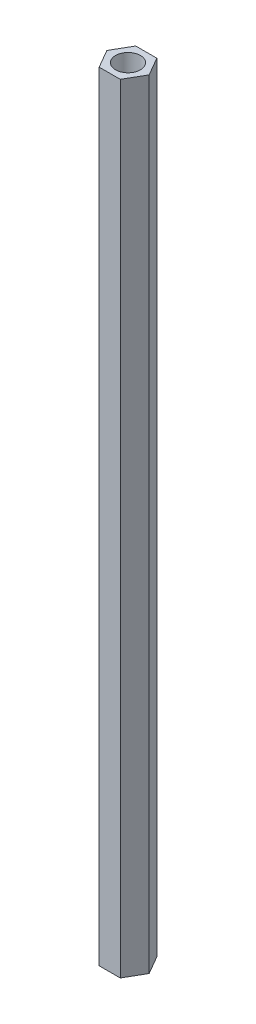
ISO-10303-21;
HEADER;
FILE_DESCRIPTION(('STEP AP214'),'2;1');
FILE_NAME('part.step','',(''),(''),'','','');
FILE_SCHEMA(('AUTOMOTIVE_DESIGN { 1 0 10303 214 1 1 1 1 }'));
ENDSEC;
DATA;
#1=APPLICATION_CONTEXT('core data for automotive mechanical design processes');
#2=APPLICATION_PROTOCOL_DEFINITION('international standard','automotive_design',2000,#1);
#3=PRODUCT_CONTEXT('',#1,'mechanical');
#4=PRODUCT('Part','Part','',(#3));
#5=PRODUCT_RELATED_PRODUCT_CATEGORY('part','',(#4));
#6=PRODUCT_DEFINITION_FORMATION('','',#4);
#7=PRODUCT_DEFINITION_CONTEXT('part definition',#1,'design');
#8=PRODUCT_DEFINITION('design','',#6,#7);
#9=PRODUCT_DEFINITION_SHAPE('','',#8);
#10=(LENGTH_UNIT() NAMED_UNIT(*) SI_UNIT(.MILLI.,.METRE.));
#11=(NAMED_UNIT(*) PLANE_ANGLE_UNIT() SI_UNIT($,.RADIAN.));
#12=(NAMED_UNIT(*) SI_UNIT($,.STERADIAN.) SOLID_ANGLE_UNIT());
#13=UNCERTAINTY_MEASURE_WITH_UNIT(LENGTH_MEASURE(1.E-05),#10,'distance_accuracy_value','');
#14=(GEOMETRIC_REPRESENTATION_CONTEXT(3) GLOBAL_UNCERTAINTY_ASSIGNED_CONTEXT((#13)) GLOBAL_UNIT_ASSIGNED_CONTEXT((#10,
#11,#12)) REPRESENTATION_CONTEXT('',''));
#15=CARTESIAN_POINT('',(0.,0.,0.));
#16=DIRECTION('',(0.,0.,1.));
#17=DIRECTION('',(1.,0.,0.));
#18=AXIS2_PLACEMENT_3D('',#15,#16,#17);
#19=CARTESIAN_POINT('',(1.35677313259562,100.,2.35));
#20=DIRECTION('',(-0.866025403784439,0.,-0.5));
#21=DIRECTION('',(-0.5,0.,0.866025403784439));
#22=AXIS2_PLACEMENT_3D('',#19,#20,#21);
#23=PLANE('',#22);
#24=DIRECTION('',(0.5,0.,-0.866025403784439));
#25=VECTOR('',#24,1.);
#26=CARTESIAN_POINT('',(1.35677313259562,0.,2.35));
#27=LINE('',#26,#25);
#28=CARTESIAN_POINT('',(1.35677313259562,0.,2.35));
#29=VERTEX_POINT('',#28);
#30=CARTESIAN_POINT('',(2.71354626519124,0.,0.));
#31=VERTEX_POINT('',#30);
#32=EDGE_CURVE('E119',#29,#31,#27,.T.);
#33=ORIENTED_EDGE('',*,*,#32,.T.);
#34=DIRECTION('',(0.,-1.,0.));
#35=VECTOR('',#34,1.);
#36=CARTESIAN_POINT('',(2.71354626519124,100.,0.));
#37=LINE('',#36,#35);
#38=CARTESIAN_POINT('',(2.71354626519124,100.,0.));
#39=VERTEX_POINT('',#38);
#40=EDGE_CURVE('E11',#39,#31,#37,.T.);
#41=ORIENTED_EDGE('',*,*,#40,.F.);
#42=DIRECTION('',(0.5,0.,-0.866025403784439));
#43=VECTOR('',#42,1.);
#44=CARTESIAN_POINT('',(1.35677313259562,100.,2.35));
#45=LINE('',#44,#43);
#46=CARTESIAN_POINT('',(1.35677313259562,100.,2.35));
#47=VERTEX_POINT('',#46);
#48=EDGE_CURVE('E130',#47,#39,#45,.T.);
#49=ORIENTED_EDGE('',*,*,#48,.F.);
#50=DIRECTION('',(0.,-1.,0.));
#51=VECTOR('',#50,1.);
#52=CARTESIAN_POINT('',(1.35677313259562,100.,2.35));
#53=LINE('',#52,#51);
#54=EDGE_CURVE('E115',#47,#29,#53,.T.);
#55=ORIENTED_EDGE('',*,*,#54,.T.);
#56=EDGE_LOOP('',(#33,#41,#49,#55));
#57=FACE_BOUND('',#56,.T.);
#58=ADVANCED_FACE('F35',(#57),#23,.F.);
#59=CARTESIAN_POINT('',(2.71354626519124,100.,0.));
#60=DIRECTION('',(-0.866025403784439,0.,0.5));
#61=DIRECTION('',(0.5,0.,0.866025403784439));
#62=AXIS2_PLACEMENT_3D('',#59,#60,#61);
#63=PLANE('',#62);
#64=DIRECTION('',(-0.5,0.,-0.866025403784439));
#65=VECTOR('',#64,1.);
#66=CARTESIAN_POINT('',(2.71354626519124,0.,0.));
#67=LINE('',#66,#65);
#68=CARTESIAN_POINT('',(1.35677313259562,0.,-2.35));
#69=VERTEX_POINT('',#68);
#70=EDGE_CURVE('E122',#31,#69,#67,.T.);
#71=ORIENTED_EDGE('',*,*,#70,.T.);
#72=DIRECTION('',(0.,-1.,0.));
#73=VECTOR('',#72,1.);
#74=CARTESIAN_POINT('',(1.35677313259562,100.,-2.35));
#75=LINE('',#74,#73);
#76=CARTESIAN_POINT('',(1.35677313259562,100.,-2.35));
#77=VERTEX_POINT('',#76);
#78=EDGE_CURVE('E43',#77,#69,#75,.T.);
#79=ORIENTED_EDGE('',*,*,#78,.F.);
#80=DIRECTION('',(-0.5,0.,-0.866025403784439));
#81=VECTOR('',#80,1.);
#82=CARTESIAN_POINT('',(2.71354626519124,100.,0.));
#83=LINE('',#82,#81);
#84=EDGE_CURVE('E88',#39,#77,#83,.T.);
#85=ORIENTED_EDGE('',*,*,#84,.F.);
#86=ORIENTED_EDGE('',*,*,#40,.T.);
#87=EDGE_LOOP('',(#71,#79,#85,#86));
#88=FACE_BOUND('',#87,.T.);
#89=ADVANCED_FACE('F155',(#88),#63,.F.);
#90=CARTESIAN_POINT('',(1.35677313259562,100.,-2.35));
#91=DIRECTION('',(0.,0.,1.));
#92=DIRECTION('',(1.,0.,0.));
#93=AXIS2_PLACEMENT_3D('',#90,#91,#92);
#94=PLANE('',#93);
#95=DIRECTION('',(-1.,0.,0.));
#96=VECTOR('',#95,1.);
#97=CARTESIAN_POINT('',(1.35677313259562,0.,-2.35));
#98=LINE('',#97,#96);
#99=CARTESIAN_POINT('',(-1.35677313259562,0.,-2.35));
#100=VERTEX_POINT('',#99);
#101=EDGE_CURVE('E125',#69,#100,#98,.T.);
#102=ORIENTED_EDGE('',*,*,#101,.T.);
#103=DIRECTION('',(0.,-1.,0.));
#104=VECTOR('',#103,1.);
#105=CARTESIAN_POINT('',(-1.35677313259562,100.,-2.35));
#106=LINE('',#105,#104);
#107=CARTESIAN_POINT('',(-1.35677313259562,100.,-2.35));
#108=VERTEX_POINT('',#107);
#109=EDGE_CURVE('E110',#108,#100,#106,.T.);
#110=ORIENTED_EDGE('',*,*,#109,.F.);
#111=DIRECTION('',(-1.,0.,0.));
#112=VECTOR('',#111,1.);
#113=CARTESIAN_POINT('',(1.35677313259562,100.,-2.35));
#114=LINE('',#113,#112);
#115=EDGE_CURVE('E101',#77,#108,#114,.T.);
#116=ORIENTED_EDGE('',*,*,#115,.F.);
#117=ORIENTED_EDGE('',*,*,#78,.T.);
#118=EDGE_LOOP('',(#102,#110,#116,#117));
#119=FACE_BOUND('',#118,.T.);
#120=ADVANCED_FACE('F136',(#119),#94,.F.);
#121=CARTESIAN_POINT('',(-1.35677313259562,100.,-2.35));
#122=DIRECTION('',(0.866025403784439,0.,0.5));
#123=DIRECTION('',(0.5,0.,-0.866025403784439));
#124=AXIS2_PLACEMENT_3D('',#121,#122,#123);
#125=PLANE('',#124);
#126=DIRECTION('',(-0.5,0.,0.866025403784439));
#127=VECTOR('',#126,1.);
#128=CARTESIAN_POINT('',(-1.35677313259562,0.,-2.35));
#129=LINE('',#128,#127);
#130=CARTESIAN_POINT('',(-2.71354626519124,0.,0.));
#131=VERTEX_POINT('',#130);
#132=EDGE_CURVE('E109',#100,#131,#129,.T.);
#133=ORIENTED_EDGE('',*,*,#132,.T.);
#134=DIRECTION('',(0.,-1.,0.));
#135=VECTOR('',#134,1.);
#136=CARTESIAN_POINT('',(-2.71354626519124,100.,0.));
#137=LINE('',#136,#135);
#138=CARTESIAN_POINT('',(-2.71354626519124,100.,0.));
#139=VERTEX_POINT('',#138);
#140=EDGE_CURVE('E106',#139,#131,#137,.T.);
#141=ORIENTED_EDGE('',*,*,#140,.F.);
#142=DIRECTION('',(-0.5,0.,0.866025403784439));
#143=VECTOR('',#142,1.);
#144=CARTESIAN_POINT('',(-1.35677313259562,100.,-2.35));
#145=LINE('',#144,#143);
#146=EDGE_CURVE('E95',#108,#139,#145,.T.);
#147=ORIENTED_EDGE('',*,*,#146,.F.);
#148=ORIENTED_EDGE('',*,*,#109,.T.);
#149=EDGE_LOOP('',(#133,#141,#147,#148));
#150=FACE_BOUND('',#149,.T.);
#151=ADVANCED_FACE('F107',(#150),#125,.F.);
#152=CARTESIAN_POINT('',(-2.71354626519124,100.,0.));
#153=DIRECTION('',(0.866025403784439,0.,-0.5));
#154=DIRECTION('',(-0.5,0.,-0.866025403784439));
#155=AXIS2_PLACEMENT_3D('',#152,#153,#154);
#156=PLANE('',#155);
#157=DIRECTION('',(0.5,0.,0.866025403784439));
#158=VECTOR('',#157,1.);
#159=CARTESIAN_POINT('',(-2.71354626519124,0.,0.));
#160=LINE('',#159,#158);
#161=CARTESIAN_POINT('',(-1.35677313259562,0.,2.35));
#162=VERTEX_POINT('',#161);
#163=EDGE_CURVE('E74',#131,#162,#160,.T.);
#164=ORIENTED_EDGE('',*,*,#163,.T.);
#165=DIRECTION('',(0.,-1.,0.));
#166=VECTOR('',#165,1.);
#167=CARTESIAN_POINT('',(-1.35677313259562,100.,2.35));
#168=LINE('',#167,#166);
#169=CARTESIAN_POINT('',(-1.35677313259562,100.,2.35));
#170=VERTEX_POINT('',#169);
#171=EDGE_CURVE('E111',#170,#162,#168,.T.);
#172=ORIENTED_EDGE('',*,*,#171,.F.);
#173=DIRECTION('',(0.5,0.,0.866025403784439));
#174=VECTOR('',#173,1.);
#175=CARTESIAN_POINT('',(-2.71354626519124,100.,0.));
#176=LINE('',#175,#174);
#177=EDGE_CURVE('E99',#139,#170,#176,.T.);
#178=ORIENTED_EDGE('',*,*,#177,.F.);
#179=ORIENTED_EDGE('',*,*,#140,.T.);
#180=EDGE_LOOP('',(#164,#172,#178,#179));
#181=FACE_BOUND('',#180,.T.);
#182=ADVANCED_FACE('F113',(#181),#156,.F.);
#183=CARTESIAN_POINT('',(-1.35677313259562,100.,2.35));
#184=DIRECTION('',(0.,0.,-1.));
#185=DIRECTION('',(-1.,0.,0.));
#186=AXIS2_PLACEMENT_3D('',#183,#184,#185);
#187=PLANE('',#186);
#188=DIRECTION('',(1.,0.,0.));
#189=VECTOR('',#188,1.);
#190=CARTESIAN_POINT('',(-1.35677313259562,0.,2.35));
#191=LINE('',#190,#189);
#192=EDGE_CURVE('E80',#162,#29,#191,.T.);
#193=ORIENTED_EDGE('',*,*,#192,.T.);
#194=ORIENTED_EDGE('',*,*,#54,.F.);
#195=DIRECTION('',(1.,0.,0.));
#196=VECTOR('',#195,1.);
#197=CARTESIAN_POINT('',(-1.35677313259562,100.,2.35));
#198=LINE('',#197,#196);
#199=EDGE_CURVE('E51',#170,#47,#198,.T.);
#200=ORIENTED_EDGE('',*,*,#199,.F.);
#201=ORIENTED_EDGE('',*,*,#171,.T.);
#202=EDGE_LOOP('',(#193,#194,#200,#201));
#203=FACE_BOUND('',#202,.T.);
#204=ADVANCED_FACE('F143',(#203),#187,.F.);
#205=CARTESIAN_POINT('',(0.,100.,0.));
#206=DIRECTION('',(0.,1.,0.));
#207=DIRECTION('',(0.,0.,1.));
#208=AXIS2_PLACEMENT_3D('',#205,#206,#207);
#209=PLANE('',#208);
#210=CARTESIAN_POINT('',(0.,100.,0.));
#211=DIRECTION('',(0.,1.,0.));
#212=DIRECTION('',(0.,0.,1.));
#213=AXIS2_PLACEMENT_3D('',#210,#211,#212);
#214=CIRCLE('',#213,1.6);
#215=CARTESIAN_POINT('',(0.,100.,1.6));
#216=VERTEX_POINT('',#215);
#217=EDGE_CURVE('E210',#216,#216,#214,.T.);
#218=ORIENTED_EDGE('',*,*,#217,.F.);
#219=EDGE_LOOP('',(#218));
#220=FACE_BOUND('',#219,.T.);
#221=ORIENTED_EDGE('',*,*,#48,.T.);
#222=ORIENTED_EDGE('',*,*,#84,.T.);
#223=ORIENTED_EDGE('',*,*,#115,.T.);
#224=ORIENTED_EDGE('',*,*,#146,.T.);
#225=ORIENTED_EDGE('',*,*,#177,.T.);
#226=ORIENTED_EDGE('',*,*,#199,.T.);
#227=EDGE_LOOP('',(#221,#222,#223,#224,#225,#226));
#228=FACE_BOUND('',#227,.T.);
#229=ADVANCED_FACE('F97',(#220,#228),#209,.T.);
#230=CARTESIAN_POINT('',(0.,0.,0.));
#231=DIRECTION('',(0.,1.,0.));
#232=DIRECTION('',(0.,0.,1.));
#233=AXIS2_PLACEMENT_3D('',#230,#231,#232);
#234=PLANE('',#233);
#235=CARTESIAN_POINT('',(0.,0.,0.));
#236=DIRECTION('',(0.,1.,0.));
#237=DIRECTION('',(0.,0.,1.));
#238=AXIS2_PLACEMENT_3D('',#235,#236,#237);
#239=CIRCLE('',#238,1.6);
#240=CARTESIAN_POINT('',(0.,0.,1.6));
#241=VERTEX_POINT('',#240);
#242=EDGE_CURVE('E123',#241,#241,#239,.T.);
#243=ORIENTED_EDGE('',*,*,#242,.T.);
#244=EDGE_LOOP('',(#243));
#245=FACE_BOUND('',#244,.T.);
#246=ORIENTED_EDGE('',*,*,#32,.F.);
#247=ORIENTED_EDGE('',*,*,#192,.F.);
#248=ORIENTED_EDGE('',*,*,#163,.F.);
#249=ORIENTED_EDGE('',*,*,#132,.F.);
#250=ORIENTED_EDGE('',*,*,#101,.F.);
#251=ORIENTED_EDGE('',*,*,#70,.F.);
#252=EDGE_LOOP('',(#246,#247,#248,#249,#250,#251));
#253=FACE_BOUND('',#252,.T.);
#254=ADVANCED_FACE('F139',(#245,#253),#234,.F.);
#255=CARTESIAN_POINT('',(0.,0.,0.));
#256=DIRECTION('',(0.,1.,0.));
#257=DIRECTION('',(0.,0.,1.));
#258=AXIS2_PLACEMENT_3D('',#255,#256,#257);
#259=CYLINDRICAL_SURFACE('',#258,1.6);
#260=ORIENTED_EDGE('',*,*,#242,.F.);
#261=EDGE_LOOP('',(#260));
#262=FACE_BOUND('',#261,.T.);
#263=ORIENTED_EDGE('',*,*,#217,.T.);
#264=EDGE_LOOP('',(#263));
#265=FACE_BOUND('',#264,.T.);
#266=ADVANCED_FACE('F192',(#262,#265),#259,.F.);
#267=CLOSED_SHELL('',(#58,#89,#120,#151,#182,#204,#229,#254,#266));
#268=MANIFOLD_SOLID_BREP('B2',#267);
#269=ADVANCED_BREP_SHAPE_REPRESENTATION('',(#18,#268),#14);
#270=SHAPE_DEFINITION_REPRESENTATION(#9,#269);
ENDSEC;
END-ISO-10303-21;
